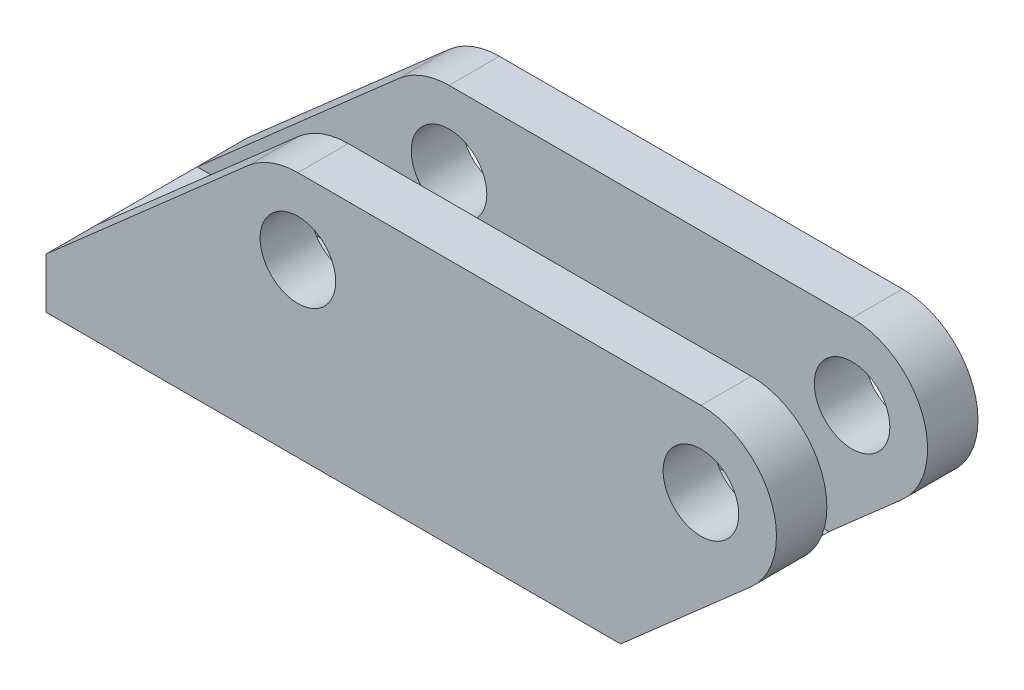
ISO-10303-21;
HEADER;
FILE_DESCRIPTION(('STEP AP214'),'2;1');
FILE_NAME('part.step','',(''),(''),'','','');
FILE_SCHEMA(('AUTOMOTIVE_DESIGN { 1 0 10303 214 1 1 1 1 }'));
ENDSEC;
DATA;
#1=APPLICATION_CONTEXT('core data for automotive mechanical design processes');
#2=APPLICATION_PROTOCOL_DEFINITION('international standard','automotive_design',2000,#1);
#3=PRODUCT_CONTEXT('',#1,'mechanical');
#4=PRODUCT('Part','Part','',(#3));
#5=PRODUCT_RELATED_PRODUCT_CATEGORY('part','',(#4));
#6=PRODUCT_DEFINITION_FORMATION('','',#4);
#7=PRODUCT_DEFINITION_CONTEXT('part definition',#1,'design');
#8=PRODUCT_DEFINITION('design','',#6,#7);
#9=PRODUCT_DEFINITION_SHAPE('','',#8);
#10=(LENGTH_UNIT() NAMED_UNIT(*) SI_UNIT(.MILLI.,.METRE.));
#11=(NAMED_UNIT(*) PLANE_ANGLE_UNIT() SI_UNIT($,.RADIAN.));
#12=(NAMED_UNIT(*) SI_UNIT($,.STERADIAN.) SOLID_ANGLE_UNIT());
#13=UNCERTAINTY_MEASURE_WITH_UNIT(LENGTH_MEASURE(1.E-05),#10,'distance_accuracy_value','');
#14=(GEOMETRIC_REPRESENTATION_CONTEXT(3) GLOBAL_UNCERTAINTY_ASSIGNED_CONTEXT((#13)) GLOBAL_UNIT_ASSIGNED_CONTEXT((#10,
#11,#12)) REPRESENTATION_CONTEXT('',''));
#15=CARTESIAN_POINT('',(0.,0.,0.));
#16=DIRECTION('',(0.,0.,1.));
#17=DIRECTION('',(1.,0.,0.));
#18=AXIS2_PLACEMENT_3D('',#15,#16,#17);
#19=CARTESIAN_POINT('',(0.,6.35,25.4));
#20=DIRECTION('',(0.,0.,-1.));
#21=DIRECTION('',(-1.,0.,0.));
#22=AXIS2_PLACEMENT_3D('',#19,#20,#21);
#23=CYLINDRICAL_SURFACE('',#22,4.7625);
#24=CARTESIAN_POINT('',(0.,6.35,0.));
#25=DIRECTION('',(0.,0.,1.));
#26=DIRECTION('',(1.,0.,0.));
#27=AXIS2_PLACEMENT_3D('',#24,#25,#26);
#28=CIRCLE('',#27,4.7625);
#29=CARTESIAN_POINT('',(4.7625,6.35,0.));
#30=VERTEX_POINT('',#29);
#31=EDGE_CURVE('E213',#30,#30,#28,.T.);
#32=ORIENTED_EDGE('',*,*,#31,.F.);
#33=EDGE_LOOP('',(#32));
#34=FACE_BOUND('',#33,.T.);
#35=CARTESIAN_POINT('',(0.,6.35,6.35));
#36=DIRECTION('',(0.,0.,1.));
#37=DIRECTION('',(1.,0.,0.));
#38=AXIS2_PLACEMENT_3D('',#35,#36,#37);
#39=CIRCLE('',#38,4.7625);
#40=CARTESIAN_POINT('',(4.7625,6.35,6.35));
#41=VERTEX_POINT('',#40);
#42=EDGE_CURVE('E273',#41,#41,#39,.T.);
#43=ORIENTED_EDGE('',*,*,#42,.T.);
#44=EDGE_LOOP('',(#43));
#45=FACE_BOUND('',#44,.T.);
#46=ADVANCED_FACE('F90',(#34,#45),#23,.F.);
#47=CARTESIAN_POINT('',(0.,15.875,25.4));
#48=DIRECTION('',(0.,1.,0.));
#49=DIRECTION('',(0.,0.,1.));
#50=AXIS2_PLACEMENT_3D('',#47,#48,#49);
#51=PLANE('',#50);
#52=DIRECTION('',(0.,0.,-1.));
#53=VECTOR('',#52,1.);
#54=CARTESIAN_POINT('',(0.,15.875,25.4));
#55=LINE('',#54,#53);
#56=CARTESIAN_POINT('',(0.,15.875,6.35));
#57=VERTEX_POINT('',#56);
#58=CARTESIAN_POINT('',(0.,15.875,0.));
#59=VERTEX_POINT('',#58);
#60=EDGE_CURVE('E225',#57,#59,#55,.T.);
#61=ORIENTED_EDGE('',*,*,#60,.F.);
#62=DIRECTION('',(1.,0.,0.));
#63=VECTOR('',#62,1.);
#64=CARTESIAN_POINT('',(0.,15.875,6.35));
#65=LINE('',#64,#63);
#66=CARTESIAN_POINT('',(50.8,15.875,6.35));
#67=VERTEX_POINT('',#66);
#68=EDGE_CURVE('E287',#57,#67,#65,.T.);
#69=ORIENTED_EDGE('',*,*,#68,.T.);
#70=DIRECTION('',(0.,0.,-1.));
#71=VECTOR('',#70,1.);
#72=CARTESIAN_POINT('',(50.8,15.875,25.4));
#73=LINE('',#72,#71);
#74=CARTESIAN_POINT('',(50.8,15.875,0.));
#75=VERTEX_POINT('',#74);
#76=EDGE_CURVE('E229',#67,#75,#73,.T.);
#77=ORIENTED_EDGE('',*,*,#76,.T.);
#78=DIRECTION('',(1.,0.,0.));
#79=VECTOR('',#78,1.);
#80=CARTESIAN_POINT('',(0.,15.875,0.));
#81=LINE('',#80,#79);
#82=EDGE_CURVE('E197',#59,#75,#81,.T.);
#83=ORIENTED_EDGE('',*,*,#82,.F.);
#84=EDGE_LOOP('',(#61,#69,#77,#83));
#85=FACE_BOUND('',#84,.T.);
#86=ADVANCED_FACE('F366',(#85),#51,.T.);
#87=CARTESIAN_POINT('',(0.,6.35,25.4));
#88=DIRECTION('',(0.,0.,-1.));
#89=DIRECTION('',(-1.,0.,0.));
#90=AXIS2_PLACEMENT_3D('',#87,#88,#89);
#91=CYLINDRICAL_SURFACE('',#90,9.525);
#92=CARTESIAN_POINT('',(0.,6.35,6.35));
#93=DIRECTION('',(0.,0.,1.));
#94=DIRECTION('',(1.,0.,0.));
#95=AXIS2_PLACEMENT_3D('',#92,#93,#94);
#96=CIRCLE('',#95,9.525);
#97=CARTESIAN_POINT('',(-6.29056933988435,13.5022277914023,6.35));
#98=VERTEX_POINT('',#97);
#99=EDGE_CURVE('E284',#57,#98,#96,.T.);
#100=ORIENTED_EDGE('',*,*,#99,.F.);
#101=ORIENTED_EDGE('',*,*,#60,.T.);
#102=CARTESIAN_POINT('',(0.,6.35,0.));
#103=DIRECTION('',(0.,0.,1.));
#104=DIRECTION('',(1.,0.,0.));
#105=AXIS2_PLACEMENT_3D('',#102,#103,#104);
#106=CIRCLE('',#105,9.525);
#107=CARTESIAN_POINT('',(-6.29056933988435,13.5022277914023,0.));
#108=VERTEX_POINT('',#107);
#109=EDGE_CURVE('E200',#59,#108,#106,.T.);
#110=ORIENTED_EDGE('',*,*,#109,.T.);
#111=DIRECTION('',(0.,0.,-1.));
#112=VECTOR('',#111,1.);
#113=CARTESIAN_POINT('',(-6.29056933988435,13.5022277914023,25.4));
#114=LINE('',#113,#112);
#115=EDGE_CURVE('E221',#98,#108,#114,.T.);
#116=ORIENTED_EDGE('',*,*,#115,.F.);
#117=EDGE_LOOP('',(#100,#101,#110,#116));
#118=FACE_BOUND('',#117,.T.);
#119=ADVANCED_FACE('F355',(#118),#91,.T.);
#120=CARTESIAN_POINT('',(-9.43958665267273,10.732585613282,25.4));
#121=DIRECTION('',(0.660427227284446,-0.750890056840133,0.));
#122=DIRECTION('',(0.750890056840133,0.660427227284446,0.));
#123=AXIS2_PLACEMENT_3D('',#120,#121,#122);
#124=PLANE('',#123);
#125=DIRECTION('',(-0.750890056840133,-0.660427227284446,0.));
#126=VECTOR('',#125,1.);
#127=CARTESIAN_POINT('',(-9.43958665267273,10.732585613282,6.35));
#128=LINE('',#127,#126);
#129=CARTESIAN_POINT('',(-31.7499999999431,-8.89,6.35));
#130=VERTEX_POINT('',#129);
#131=EDGE_CURVE('E281',#98,#130,#128,.T.);
#132=ORIENTED_EDGE('',*,*,#131,.F.);
#133=ORIENTED_EDGE('',*,*,#115,.T.);
#134=DIRECTION('',(-0.750890056840133,-0.660427227284446,0.));
#135=VECTOR('',#134,1.);
#136=CARTESIAN_POINT('',(-9.43958665267273,10.732585613282,0.));
#137=LINE('',#136,#135);
#138=CARTESIAN_POINT('',(-31.7499999999431,-8.89,0.));
#139=VERTEX_POINT('',#138);
#140=EDGE_CURVE('E204',#108,#139,#137,.T.);
#141=ORIENTED_EDGE('',*,*,#140,.T.);
#142=DIRECTION('',(0.,0.,-1.));
#143=VECTOR('',#142,1.);
#144=CARTESIAN_POINT('',(-31.7499999999431,-8.89,25.4));
#145=LINE('',#144,#143);
#146=EDGE_CURVE('E175',#130,#139,#145,.T.);
#147=ORIENTED_EDGE('',*,*,#146,.F.);
#148=EDGE_LOOP('',(#132,#133,#141,#147));
#149=FACE_BOUND('',#148,.T.);
#150=ADVANCED_FACE('F354',(#149),#124,.F.);
#151=CARTESIAN_POINT('',(25.298689452058,-28.7640084718295,25.4));
#152=DIRECTION('',(0.660427227284446,-0.750890056840133,0.));
#153=DIRECTION('',(0.750890056840133,0.660427227284446,0.));
#154=AXIS2_PLACEMENT_3D('',#151,#152,#153);
#155=PLANE('',#154);
#156=DIRECTION('',(0.,0.,-1.));
#157=VECTOR('',#156,1.);
#158=CARTESIAN_POINT('',(57.0905693398844,-0.802227791402269,25.4));
#159=LINE('',#158,#157);
#160=CARTESIAN_POINT('',(57.0905693398844,-0.802227791402264,6.35));
#161=VERTEX_POINT('',#160);
#162=CARTESIAN_POINT('',(57.0905693398844,-0.802227791402269,0.));
#163=VERTEX_POINT('',#162);
#164=EDGE_CURVE('E141',#161,#163,#159,.T.);
#165=ORIENTED_EDGE('',*,*,#164,.F.);
#166=DIRECTION('',(-0.750890056840133,-0.660427227284446,0.));
#167=VECTOR('',#166,1.);
#168=CARTESIAN_POINT('',(25.298689452058,-28.7640084718295,6.35));
#169=LINE('',#168,#167);
#170=CARTESIAN_POINT('',(47.8949646123277,-8.88999999999999,6.35));
#171=VERTEX_POINT('',#170);
#172=EDGE_CURVE('E290',#161,#171,#169,.T.);
#173=ORIENTED_EDGE('',*,*,#172,.T.);
#174=DIRECTION('',(0.,0.,1.));
#175=VECTOR('',#174,1.);
#176=CARTESIAN_POINT('',(47.8949646123277,-8.89,25.4));
#177=LINE('',#176,#175);
#178=CARTESIAN_POINT('',(47.8949646123277,-8.88999999999999,19.05));
#179=VERTEX_POINT('',#178);
#180=EDGE_CURVE('E304',#171,#179,#177,.T.);
#181=ORIENTED_EDGE('',*,*,#180,.T.);
#182=DIRECTION('',(-0.750890056840133,-0.660427227284446,0.));
#183=VECTOR('',#182,1.);
#184=CARTESIAN_POINT('',(25.298689452058,-28.7640084718295,19.05));
#185=LINE('',#184,#183);
#186=CARTESIAN_POINT('',(57.0905693398844,-0.802227791402264,19.05));
#187=VERTEX_POINT('',#186);
#188=EDGE_CURVE('E262',#187,#179,#185,.T.);
#189=ORIENTED_EDGE('',*,*,#188,.F.);
#190=CARTESIAN_POINT('',(57.0905693398844,-0.802227791402269,25.4));
#191=VERTEX_POINT('',#190);
#192=EDGE_CURVE('E107',#191,#187,#159,.T.);
#193=ORIENTED_EDGE('',*,*,#192,.F.);
#194=DIRECTION('',(-0.750890056840133,-0.660427227284447,0.));
#195=VECTOR('',#194,1.);
#196=CARTESIAN_POINT('',(25.298689452058,-28.7640084718295,25.4));
#197=LINE('',#196,#195);
#198=CARTESIAN_POINT('',(40.6751655732411,-15.24,25.4));
#199=VERTEX_POINT('',#198);
#200=EDGE_CURVE('E181',#191,#199,#197,.T.);
#201=ORIENTED_EDGE('',*,*,#200,.T.);
#202=DIRECTION('',(0.,0.,-1.));
#203=VECTOR('',#202,1.);
#204=CARTESIAN_POINT('',(40.6751655732411,-15.24,25.4));
#205=LINE('',#204,#203);
#206=CARTESIAN_POINT('',(40.6751655732411,-15.24,0.));
#207=VERTEX_POINT('',#206);
#208=EDGE_CURVE('E133',#199,#207,#205,.T.);
#209=ORIENTED_EDGE('',*,*,#208,.T.);
#210=DIRECTION('',(-0.750890056840133,-0.660427227284447,0.));
#211=VECTOR('',#210,1.);
#212=CARTESIAN_POINT('',(25.298689452058,-28.7640084718295,0.));
#213=LINE('',#212,#211);
#214=EDGE_CURVE('E210',#163,#207,#213,.T.);
#215=ORIENTED_EDGE('',*,*,#214,.F.);
#216=EDGE_LOOP('',(#165,#173,#181,#189,#193,#201,#209,#215));
#217=FACE_BOUND('',#216,.T.);
#218=ADVANCED_FACE('F362',(#217),#155,.T.);
#219=CARTESIAN_POINT('',(50.8,6.35,25.4));
#220=DIRECTION('',(0.,0.,-1.));
#221=DIRECTION('',(-1.,0.,0.));
#222=AXIS2_PLACEMENT_3D('',#219,#220,#221);
#223=CYLINDRICAL_SURFACE('',#222,4.7625);
#224=CARTESIAN_POINT('',(50.8,6.35,0.));
#225=DIRECTION('',(0.,0.,1.));
#226=DIRECTION('',(1.,0.,0.));
#227=AXIS2_PLACEMENT_3D('',#224,#225,#226);
#228=CIRCLE('',#227,4.7625);
#229=CARTESIAN_POINT('',(55.5625,6.35,0.));
#230=VERTEX_POINT('',#229);
#231=EDGE_CURVE('E235',#230,#230,#228,.T.);
#232=ORIENTED_EDGE('',*,*,#231,.F.);
#233=EDGE_LOOP('',(#232));
#234=FACE_BOUND('',#233,.T.);
#235=CARTESIAN_POINT('',(50.8,6.35,6.35));
#236=DIRECTION('',(0.,0.,1.));
#237=DIRECTION('',(1.,0.,0.));
#238=AXIS2_PLACEMENT_3D('',#235,#236,#237);
#239=CIRCLE('',#238,4.7625);
#240=CARTESIAN_POINT('',(55.5625,6.35,6.35));
#241=VERTEX_POINT('',#240);
#242=EDGE_CURVE('E278',#241,#241,#239,.T.);
#243=ORIENTED_EDGE('',*,*,#242,.T.);
#244=EDGE_LOOP('',(#243));
#245=FACE_BOUND('',#244,.T.);
#246=ADVANCED_FACE('F397',(#234,#245),#223,.F.);
#247=CARTESIAN_POINT('',(50.8,6.35,25.4));
#248=DIRECTION('',(0.,0.,-1.));
#249=DIRECTION('',(-1.,0.,0.));
#250=AXIS2_PLACEMENT_3D('',#247,#248,#249);
#251=CYLINDRICAL_SURFACE('',#250,9.525);
#252=ORIENTED_EDGE('',*,*,#76,.F.);
#253=CARTESIAN_POINT('',(50.8,6.35,6.35));
#254=DIRECTION('',(0.,0.,1.));
#255=DIRECTION('',(1.,0.,0.));
#256=AXIS2_PLACEMENT_3D('',#253,#254,#255);
#257=CIRCLE('',#256,9.525);
#258=EDGE_CURVE('E12',#161,#67,#257,.T.);
#259=ORIENTED_EDGE('',*,*,#258,.F.);
#260=ORIENTED_EDGE('',*,*,#164,.T.);
#261=CARTESIAN_POINT('',(50.8,6.35,0.));
#262=DIRECTION('',(0.,0.,1.));
#263=DIRECTION('',(1.,0.,0.));
#264=AXIS2_PLACEMENT_3D('',#261,#262,#263);
#265=CIRCLE('',#264,9.525);
#266=EDGE_CURVE('E234',#163,#75,#265,.T.);
#267=ORIENTED_EDGE('',*,*,#266,.T.);
#268=EDGE_LOOP('',(#252,#259,#260,#267));
#269=FACE_BOUND('',#268,.T.);
#270=ADVANCED_FACE('F92',(#269),#251,.T.);
#271=CARTESIAN_POINT('',(50.8,6.35,19.05));
#272=DIRECTION('',(0.,0.,1.));
#273=DIRECTION('',(1.,0.,0.));
#274=AXIS2_PLACEMENT_3D('',#271,#272,#273);
#275=CIRCLE('',#274,9.525);
#276=CARTESIAN_POINT('',(50.8,15.875,19.05));
#277=VERTEX_POINT('',#276);
#278=EDGE_CURVE('E99',#187,#277,#275,.T.);
#279=ORIENTED_EDGE('',*,*,#278,.T.);
#280=CARTESIAN_POINT('',(50.8,15.875,25.4));
#281=VERTEX_POINT('',#280);
#282=EDGE_CURVE('E149',#281,#277,#73,.T.);
#283=ORIENTED_EDGE('',*,*,#282,.F.);
#284=CARTESIAN_POINT('',(50.8,6.35,25.4));
#285=DIRECTION('',(0.,0.,1.));
#286=DIRECTION('',(1.,0.,0.));
#287=AXIS2_PLACEMENT_3D('',#284,#285,#286);
#288=CIRCLE('',#287,9.525);
#289=EDGE_CURVE('E201',#191,#281,#288,.T.);
#290=ORIENTED_EDGE('',*,*,#289,.F.);
#291=ORIENTED_EDGE('',*,*,#192,.T.);
#292=EDGE_LOOP('',(#279,#283,#290,#291));
#293=FACE_BOUND('',#292,.T.);
#294=ADVANCED_FACE('F248',(#293),#251,.T.);
#295=CARTESIAN_POINT('',(19.05,15.875,12.7));
#296=DIRECTION('',(0.,-1.,0.));
#297=DIRECTION('',(1.,0.,0.));
#298=AXIS2_PLACEMENT_3D('',#295,#296,#297);
#299=CYLINDRICAL_SURFACE('',#298,3.175);
#300=CARTESIAN_POINT('',(19.05,-15.24,12.7));
#301=DIRECTION('',(0.,-1.,0.));
#302=DIRECTION('',(1.,0.,0.));
#303=AXIS2_PLACEMENT_3D('',#300,#301,#302);
#304=CIRCLE('',#303,3.175);
#305=CARTESIAN_POINT('',(22.225,-15.24,12.7));
#306=VERTEX_POINT('',#305);
#307=EDGE_CURVE('E270',#306,#306,#304,.T.);
#308=ORIENTED_EDGE('',*,*,#307,.T.);
#309=EDGE_LOOP('',(#308));
#310=FACE_BOUND('',#309,.T.);
#311=CARTESIAN_POINT('',(19.05,-8.89,12.7));
#312=DIRECTION('',(0.,1.,0.));
#313=DIRECTION('',(0.,0.,1.));
#314=AXIS2_PLACEMENT_3D('',#311,#312,#313);
#315=CIRCLE('',#314,3.175);
#316=CARTESIAN_POINT('',(19.05,-8.89,15.875));
#317=VERTEX_POINT('',#316);
#318=EDGE_CURVE('E243',#317,#317,#315,.F.);
#319=ORIENTED_EDGE('',*,*,#318,.F.);
#320=EDGE_LOOP('',(#319));
#321=FACE_BOUND('',#320,.T.);
#322=ADVANCED_FACE('F387',(#310,#321),#299,.F.);
#323=CARTESIAN_POINT('',(-19.05,15.875,12.7));
#324=DIRECTION('',(0.,-1.,0.));
#325=DIRECTION('',(1.,0.,0.));
#326=AXIS2_PLACEMENT_3D('',#323,#324,#325);
#327=CYLINDRICAL_SURFACE('',#326,3.175);
#328=CARTESIAN_POINT('',(-19.05,-15.24,12.7));
#329=DIRECTION('',(0.,-1.,0.));
#330=DIRECTION('',(1.,0.,0.));
#331=AXIS2_PLACEMENT_3D('',#328,#329,#330);
#332=CIRCLE('',#331,3.175);
#333=CARTESIAN_POINT('',(-15.875,-15.24,12.7));
#334=VERTEX_POINT('',#333);
#335=EDGE_CURVE('E238',#334,#334,#332,.T.);
#336=ORIENTED_EDGE('',*,*,#335,.T.);
#337=EDGE_LOOP('',(#336));
#338=FACE_BOUND('',#337,.T.);
#339=CARTESIAN_POINT('',(-19.05,-8.89,12.7));
#340=DIRECTION('',(0.,1.,0.));
#341=DIRECTION('',(0.,0.,1.));
#342=AXIS2_PLACEMENT_3D('',#339,#340,#341);
#343=CIRCLE('',#342,3.175);
#344=CARTESIAN_POINT('',(-19.05,-8.89,15.875));
#345=VERTEX_POINT('',#344);
#346=EDGE_CURVE('E241',#345,#345,#343,.F.);
#347=ORIENTED_EDGE('',*,*,#346,.F.);
#348=EDGE_LOOP('',(#347));
#349=FACE_BOUND('',#348,.T.);
#350=ADVANCED_FACE('F382',(#338,#349),#327,.F.);
#351=CARTESIAN_POINT('',(0.,6.35,19.05));
#352=DIRECTION('',(0.,0.,1.));
#353=DIRECTION('',(1.,0.,0.));
#354=AXIS2_PLACEMENT_3D('',#351,#352,#353);
#355=CIRCLE('',#354,4.7625);
#356=CARTESIAN_POINT('',(4.7625,6.35,19.05));
#357=VERTEX_POINT('',#356);
#358=EDGE_CURVE('E293',#357,#357,#355,.T.);
#359=ORIENTED_EDGE('',*,*,#358,.F.);
#360=EDGE_LOOP('',(#359));
#361=FACE_BOUND('',#360,.T.);
#362=CARTESIAN_POINT('',(0.,6.35,25.4));
#363=DIRECTION('',(0.,0.,1.));
#364=DIRECTION('',(1.,0.,0.));
#365=AXIS2_PLACEMENT_3D('',#362,#363,#364);
#366=CIRCLE('',#365,4.7625);
#367=CARTESIAN_POINT('',(4.7625,6.35,25.4));
#368=VERTEX_POINT('',#367);
#369=EDGE_CURVE('E194',#368,#368,#366,.T.);
#370=ORIENTED_EDGE('',*,*,#369,.T.);
#371=EDGE_LOOP('',(#370));
#372=FACE_BOUND('',#371,.T.);
#373=ADVANCED_FACE('F376',(#361,#372),#23,.F.);
#374=DIRECTION('',(1.,0.,0.));
#375=VECTOR('',#374,1.);
#376=CARTESIAN_POINT('',(0.,15.875,19.05));
#377=LINE('',#376,#375);
#378=CARTESIAN_POINT('',(0.,15.875,19.05));
#379=VERTEX_POINT('',#378);
#380=EDGE_CURVE('E256',#379,#277,#377,.T.);
#381=ORIENTED_EDGE('',*,*,#380,.F.);
#382=CARTESIAN_POINT('',(0.,15.875,25.4));
#383=VERTEX_POINT('',#382);
#384=EDGE_CURVE('E226',#383,#379,#55,.T.);
#385=ORIENTED_EDGE('',*,*,#384,.F.);
#386=DIRECTION('',(1.,0.,0.));
#387=VECTOR('',#386,1.);
#388=CARTESIAN_POINT('',(0.,15.875,25.4));
#389=LINE('',#388,#387);
#390=EDGE_CURVE('E216',#383,#281,#389,.T.);
#391=ORIENTED_EDGE('',*,*,#390,.T.);
#392=ORIENTED_EDGE('',*,*,#282,.T.);
#393=EDGE_LOOP('',(#381,#385,#391,#392));
#394=FACE_BOUND('',#393,.T.);
#395=ADVANCED_FACE('F265',(#394),#51,.T.);
#396=ORIENTED_EDGE('',*,*,#384,.T.);
#397=CARTESIAN_POINT('',(0.,6.35,19.05));
#398=DIRECTION('',(0.,0.,1.));
#399=DIRECTION('',(1.,0.,0.));
#400=AXIS2_PLACEMENT_3D('',#397,#398,#399);
#401=CIRCLE('',#400,9.525);
#402=CARTESIAN_POINT('',(-6.29056933988435,13.5022277914023,19.05));
#403=VERTEX_POINT('',#402);
#404=EDGE_CURVE('E260',#379,#403,#401,.T.);
#405=ORIENTED_EDGE('',*,*,#404,.T.);
#406=CARTESIAN_POINT('',(-6.29056933988435,13.5022277914023,25.4));
#407=VERTEX_POINT('',#406);
#408=EDGE_CURVE('E222',#407,#403,#114,.T.);
#409=ORIENTED_EDGE('',*,*,#408,.F.);
#410=CARTESIAN_POINT('',(0.,6.35,25.4));
#411=DIRECTION('',(0.,0.,1.));
#412=DIRECTION('',(1.,0.,0.));
#413=AXIS2_PLACEMENT_3D('',#410,#411,#412);
#414=CIRCLE('',#413,9.525);
#415=EDGE_CURVE('E189',#383,#407,#414,.T.);
#416=ORIENTED_EDGE('',*,*,#415,.F.);
#417=EDGE_LOOP('',(#396,#405,#409,#416));
#418=FACE_BOUND('',#417,.T.);
#419=ADVANCED_FACE('F337',(#418),#91,.T.);
#420=ORIENTED_EDGE('',*,*,#408,.T.);
#421=DIRECTION('',(-0.750890056840133,-0.660427227284446,0.));
#422=VECTOR('',#421,1.);
#423=CARTESIAN_POINT('',(-9.43958665267273,10.732585613282,19.05));
#424=LINE('',#423,#422);
#425=CARTESIAN_POINT('',(-31.7499999999431,-8.89,19.05));
#426=VERTEX_POINT('',#425);
#427=EDGE_CURVE('E299',#403,#426,#424,.T.);
#428=ORIENTED_EDGE('',*,*,#427,.T.);
#429=CARTESIAN_POINT('',(-31.7499999999431,-8.89,25.4));
#430=VERTEX_POINT('',#429);
#431=EDGE_CURVE('E219',#430,#426,#145,.T.);
#432=ORIENTED_EDGE('',*,*,#431,.F.);
#433=DIRECTION('',(-0.750890056840133,-0.660427227284446,0.));
#434=VECTOR('',#433,1.);
#435=CARTESIAN_POINT('',(-9.43958665267273,10.732585613282,25.4));
#436=LINE('',#435,#434);
#437=EDGE_CURVE('E186',#407,#430,#436,.T.);
#438=ORIENTED_EDGE('',*,*,#437,.F.);
#439=EDGE_LOOP('',(#420,#428,#432,#438));
#440=FACE_BOUND('',#439,.T.);
#441=ADVANCED_FACE('F331',(#440),#124,.F.);
#442=CARTESIAN_POINT('',(-31.7499999999431,0.,25.4));
#443=DIRECTION('',(-1.,0.,0.));
#444=DIRECTION('',(0.,0.,1.));
#445=AXIS2_PLACEMENT_3D('',#442,#443,#444);
#446=PLANE('',#445);
#447=DIRECTION('',(0.,1.,0.));
#448=VECTOR('',#447,1.);
#449=CARTESIAN_POINT('',(-31.7499999999431,0.,0.));
#450=LINE('',#449,#448);
#451=CARTESIAN_POINT('',(-31.7499999999431,-15.24,0.));
#452=VERTEX_POINT('',#451);
#453=EDGE_CURVE('E172',#452,#139,#450,.T.);
#454=ORIENTED_EDGE('',*,*,#453,.F.);
#455=DIRECTION('',(0.,0.,-1.));
#456=VECTOR('',#455,1.);
#457=CARTESIAN_POINT('',(-31.7499999999431,-15.24,25.4));
#458=LINE('',#457,#456);
#459=CARTESIAN_POINT('',(-31.7499999999431,-15.24,25.4));
#460=VERTEX_POINT('',#459);
#461=EDGE_CURVE('E165',#460,#452,#458,.T.);
#462=ORIENTED_EDGE('',*,*,#461,.F.);
#463=DIRECTION('',(0.,1.,0.));
#464=VECTOR('',#463,1.);
#465=CARTESIAN_POINT('',(-31.7499999999431,0.,25.4));
#466=LINE('',#465,#464);
#467=EDGE_CURVE('E170',#460,#430,#466,.T.);
#468=ORIENTED_EDGE('',*,*,#467,.T.);
#469=ORIENTED_EDGE('',*,*,#431,.T.);
#470=DIRECTION('',(0.,0.,-1.));
#471=VECTOR('',#470,1.);
#472=CARTESIAN_POINT('',(-31.7499999999431,-8.89,0.));
#473=LINE('',#472,#471);
#474=EDGE_CURVE('E312',#426,#130,#473,.T.);
#475=ORIENTED_EDGE('',*,*,#474,.T.);
#476=ORIENTED_EDGE('',*,*,#146,.T.);
#477=EDGE_LOOP('',(#454,#462,#468,#469,#475,#476));
#478=FACE_BOUND('',#477,.T.);
#479=ADVANCED_FACE('F167',(#478),#446,.T.);
#480=CARTESIAN_POINT('',(0.,-15.24,25.4));
#481=DIRECTION('',(0.,1.,0.));
#482=DIRECTION('',(-1.,0.,0.));
#483=AXIS2_PLACEMENT_3D('',#480,#481,#482);
#484=PLANE('',#483);
#485=ORIENTED_EDGE('',*,*,#335,.F.);
#486=EDGE_LOOP('',(#485));
#487=FACE_BOUND('',#486,.T.);
#488=ORIENTED_EDGE('',*,*,#307,.F.);
#489=EDGE_LOOP('',(#488));
#490=FACE_BOUND('',#489,.T.);
#491=DIRECTION('',(1.,0.,0.));
#492=VECTOR('',#491,1.);
#493=CARTESIAN_POINT('',(0.,-15.24,0.));
#494=LINE('',#493,#492);
#495=EDGE_CURVE('E208',#452,#207,#494,.T.);
#496=ORIENTED_EDGE('',*,*,#495,.T.);
#497=ORIENTED_EDGE('',*,*,#208,.F.);
#498=DIRECTION('',(1.,0.,0.));
#499=VECTOR('',#498,1.);
#500=CARTESIAN_POINT('',(0.,-15.24,25.4));
#501=LINE('',#500,#499);
#502=EDGE_CURVE('E177',#460,#199,#501,.T.);
#503=ORIENTED_EDGE('',*,*,#502,.F.);
#504=ORIENTED_EDGE('',*,*,#461,.T.);
#505=EDGE_LOOP('',(#496,#497,#503,#504));
#506=FACE_BOUND('',#505,.T.);
#507=ADVANCED_FACE('F178',(#487,#490,#506),#484,.F.);
#508=CARTESIAN_POINT('',(0.,0.,0.));
#509=DIRECTION('',(0.,0.,1.));
#510=DIRECTION('',(1.,0.,0.));
#511=AXIS2_PLACEMENT_3D('',#508,#509,#510);
#512=PLANE('',#511);
#513=ORIENTED_EDGE('',*,*,#82,.T.);
#514=ORIENTED_EDGE('',*,*,#266,.F.);
#515=ORIENTED_EDGE('',*,*,#214,.T.);
#516=ORIENTED_EDGE('',*,*,#495,.F.);
#517=ORIENTED_EDGE('',*,*,#453,.T.);
#518=ORIENTED_EDGE('',*,*,#140,.F.);
#519=ORIENTED_EDGE('',*,*,#109,.F.);
#520=EDGE_LOOP('',(#513,#514,#515,#516,#517,#518,#519));
#521=FACE_BOUND('',#520,.T.);
#522=ORIENTED_EDGE('',*,*,#31,.T.);
#523=EDGE_LOOP('',(#522));
#524=FACE_BOUND('',#523,.T.);
#525=ORIENTED_EDGE('',*,*,#231,.T.);
#526=EDGE_LOOP('',(#525));
#527=FACE_BOUND('',#526,.T.);
#528=ADVANCED_FACE('F360',(#521,#524,#527),#512,.F.);
#529=CARTESIAN_POINT('',(0.,0.,25.4));
#530=DIRECTION('',(0.,0.,1.));
#531=DIRECTION('',(1.,0.,0.));
#532=AXIS2_PLACEMENT_3D('',#529,#530,#531);
#533=PLANE('',#532);
#534=ORIENTED_EDGE('',*,*,#200,.F.);
#535=ORIENTED_EDGE('',*,*,#289,.T.);
#536=ORIENTED_EDGE('',*,*,#390,.F.);
#537=ORIENTED_EDGE('',*,*,#415,.T.);
#538=ORIENTED_EDGE('',*,*,#437,.T.);
#539=ORIENTED_EDGE('',*,*,#467,.F.);
#540=ORIENTED_EDGE('',*,*,#502,.T.);
#541=EDGE_LOOP('',(#534,#535,#536,#537,#538,#539,#540));
#542=FACE_BOUND('',#541,.T.);
#543=ORIENTED_EDGE('',*,*,#369,.F.);
#544=EDGE_LOOP('',(#543));
#545=FACE_BOUND('',#544,.T.);
#546=CARTESIAN_POINT('',(50.8,6.35,25.4));
#547=DIRECTION('',(0.,0.,1.));
#548=DIRECTION('',(1.,0.,0.));
#549=AXIS2_PLACEMENT_3D('',#546,#547,#548);
#550=CIRCLE('',#549,4.7625);
#551=CARTESIAN_POINT('',(55.5625,6.35,25.4));
#552=VERTEX_POINT('',#551);
#553=EDGE_CURVE('E231',#552,#552,#550,.T.);
#554=ORIENTED_EDGE('',*,*,#553,.F.);
#555=EDGE_LOOP('',(#554));
#556=FACE_BOUND('',#555,.T.);
#557=ADVANCED_FACE('F183',(#542,#545,#556),#533,.T.);
#558=CARTESIAN_POINT('',(50.8,6.35,19.05));
#559=DIRECTION('',(0.,0.,1.));
#560=DIRECTION('',(1.,0.,0.));
#561=AXIS2_PLACEMENT_3D('',#558,#559,#560);
#562=CIRCLE('',#561,4.7625);
#563=CARTESIAN_POINT('',(55.5625,6.35,19.05));
#564=VERTEX_POINT('',#563);
#565=EDGE_CURVE('E296',#564,#564,#562,.T.);
#566=ORIENTED_EDGE('',*,*,#565,.F.);
#567=EDGE_LOOP('',(#566));
#568=FACE_BOUND('',#567,.T.);
#569=ORIENTED_EDGE('',*,*,#553,.T.);
#570=EDGE_LOOP('',(#569));
#571=FACE_BOUND('',#570,.T.);
#572=ADVANCED_FACE('F422',(#568,#571),#223,.F.);
#573=CARTESIAN_POINT('',(60.325,0.,6.35));
#574=DIRECTION('',(0.,0.,1.));
#575=DIRECTION('',(1.,0.,0.));
#576=AXIS2_PLACEMENT_3D('',#573,#574,#575);
#577=PLANE('',#576);
#578=ORIENTED_EDGE('',*,*,#42,.F.);
#579=EDGE_LOOP('',(#578));
#580=FACE_BOUND('',#579,.T.);
#581=ORIENTED_EDGE('',*,*,#242,.F.);
#582=EDGE_LOOP('',(#581));
#583=FACE_BOUND('',#582,.T.);
#584=ORIENTED_EDGE('',*,*,#131,.T.);
#585=DIRECTION('',(-1.,0.,0.));
#586=VECTOR('',#585,1.);
#587=CARTESIAN_POINT('',(60.325,-8.89,6.35));
#588=LINE('',#587,#586);
#589=EDGE_CURVE('E244',#171,#130,#588,.T.);
#590=ORIENTED_EDGE('',*,*,#589,.F.);
#591=ORIENTED_EDGE('',*,*,#172,.F.);
#592=ORIENTED_EDGE('',*,*,#258,.T.);
#593=ORIENTED_EDGE('',*,*,#68,.F.);
#594=ORIENTED_EDGE('',*,*,#99,.T.);
#595=EDGE_LOOP('',(#584,#590,#591,#592,#593,#594));
#596=FACE_BOUND('',#595,.T.);
#597=ADVANCED_FACE('F349',(#580,#583,#596),#577,.T.);
#598=CARTESIAN_POINT('',(60.325,0.,19.05));
#599=DIRECTION('',(0.,0.,1.));
#600=DIRECTION('',(1.,0.,0.));
#601=AXIS2_PLACEMENT_3D('',#598,#599,#600);
#602=PLANE('',#601);
#603=ORIENTED_EDGE('',*,*,#358,.T.);
#604=EDGE_LOOP('',(#603));
#605=FACE_BOUND('',#604,.T.);
#606=ORIENTED_EDGE('',*,*,#565,.T.);
#607=EDGE_LOOP('',(#606));
#608=FACE_BOUND('',#607,.T.);
#609=ORIENTED_EDGE('',*,*,#404,.F.);
#610=ORIENTED_EDGE('',*,*,#380,.T.);
#611=ORIENTED_EDGE('',*,*,#278,.F.);
#612=ORIENTED_EDGE('',*,*,#188,.T.);
#613=DIRECTION('',(-1.,0.,0.));
#614=VECTOR('',#613,1.);
#615=CARTESIAN_POINT('',(60.325,-8.89,19.05));
#616=LINE('',#615,#614);
#617=EDGE_CURVE('E309',#179,#426,#616,.T.);
#618=ORIENTED_EDGE('',*,*,#617,.T.);
#619=ORIENTED_EDGE('',*,*,#427,.F.);
#620=EDGE_LOOP('',(#609,#610,#611,#612,#618,#619));
#621=FACE_BOUND('',#620,.T.);
#622=ADVANCED_FACE('F257',(#605,#608,#621),#602,.F.);
#623=CARTESIAN_POINT('',(60.325,-8.89,0.));
#624=DIRECTION('',(0.,1.,0.));
#625=DIRECTION('',(0.,0.,1.));
#626=AXIS2_PLACEMENT_3D('',#623,#624,#625);
#627=PLANE('',#626);
#628=ORIENTED_EDGE('',*,*,#589,.T.);
#629=ORIENTED_EDGE('',*,*,#474,.F.);
#630=ORIENTED_EDGE('',*,*,#617,.F.);
#631=ORIENTED_EDGE('',*,*,#180,.F.);
#632=EDGE_LOOP('',(#628,#629,#630,#631));
#633=FACE_BOUND('',#632,.T.);
#634=ORIENTED_EDGE('',*,*,#346,.T.);
#635=EDGE_LOOP('',(#634));
#636=FACE_BOUND('',#635,.T.);
#637=ORIENTED_EDGE('',*,*,#318,.T.);
#638=EDGE_LOOP('',(#637));
#639=FACE_BOUND('',#638,.T.);
#640=ADVANCED_FACE('F324',(#633,#636,#639),#627,.T.);
#641=CLOSED_SHELL('',(#46,#86,#119,#150,#218,#246,#270,#294,#322,#350,#373,#395,#419,#441,#479,
#507,#528,#557,#572,#597,#622,#640));
#642=MANIFOLD_SOLID_BREP('B2',#641);
#643=ADVANCED_BREP_SHAPE_REPRESENTATION('',(#18,#642),#14);
#644=SHAPE_DEFINITION_REPRESENTATION(#9,#643);
ENDSEC;
END-ISO-10303-21;
